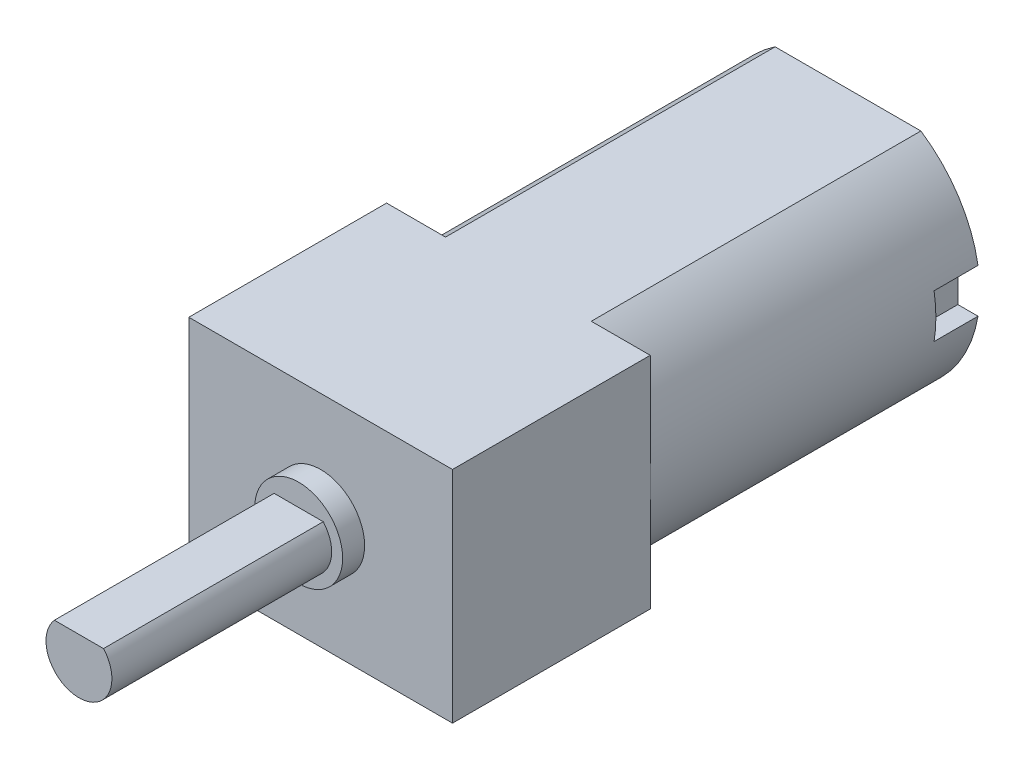
ISO-10303-21;
HEADER;
FILE_DESCRIPTION(('STEP AP214'),'2;1');
FILE_NAME('part.step','',(''),(''),'','','');
FILE_SCHEMA(('AUTOMOTIVE_DESIGN { 1 0 10303 214 1 1 1 1 }'));
ENDSEC;
DATA;
#1=APPLICATION_CONTEXT('core data for automotive mechanical design processes');
#2=APPLICATION_PROTOCOL_DEFINITION('international standard','automotive_design',2000,#1);
#3=PRODUCT_CONTEXT('',#1,'mechanical');
#4=PRODUCT('Part','Part','',(#3));
#5=PRODUCT_RELATED_PRODUCT_CATEGORY('part','',(#4));
#6=PRODUCT_DEFINITION_FORMATION('','',#4);
#7=PRODUCT_DEFINITION_CONTEXT('part definition',#1,'design');
#8=PRODUCT_DEFINITION('design','',#6,#7);
#9=PRODUCT_DEFINITION_SHAPE('','',#8);
#10=(LENGTH_UNIT() NAMED_UNIT(*) SI_UNIT(.MILLI.,.METRE.));
#11=(NAMED_UNIT(*) PLANE_ANGLE_UNIT() SI_UNIT($,.RADIAN.));
#12=(NAMED_UNIT(*) SI_UNIT($,.STERADIAN.) SOLID_ANGLE_UNIT());
#13=UNCERTAINTY_MEASURE_WITH_UNIT(LENGTH_MEASURE(1.E-05),#10,'distance_accuracy_value','');
#14=(GEOMETRIC_REPRESENTATION_CONTEXT(3) GLOBAL_UNCERTAINTY_ASSIGNED_CONTEXT((#13)) GLOBAL_UNIT_ASSIGNED_CONTEXT((#10,
#11,#12)) REPRESENTATION_CONTEXT('',''));
#15=CARTESIAN_POINT('',(0.,0.,0.));
#16=DIRECTION('',(0.,0.,1.));
#17=DIRECTION('',(1.,0.,0.));
#18=AXIS2_PLACEMENT_3D('',#15,#16,#17);
#19=CARTESIAN_POINT('',(0.,5.,0.));
#20=DIRECTION('',(0.,0.,1.));
#21=DIRECTION('',(1.,0.,0.));
#22=AXIS2_PLACEMENT_3D('',#19,#20,#21);
#23=PLANE('',#22);
#24=CARTESIAN_POINT('',(0.,5.,0.));
#25=DIRECTION('',(0.,0.,1.));
#26=DIRECTION('',(1.,0.,0.));
#27=AXIS2_PLACEMENT_3D('',#24,#25,#26);
#28=CIRCLE('',#27,2.5);
#29=CARTESIAN_POINT('',(2.5,5.,0.));
#30=VERTEX_POINT('',#29);
#31=EDGE_CURVE('E283',#30,#30,#28,.T.);
#32=ORIENTED_EDGE('',*,*,#31,.T.);
#33=EDGE_LOOP('',(#32));
#34=FACE_BOUND('',#33,.T.);
#35=DIRECTION('',(1.,0.,0.));
#36=VECTOR('',#35,1.);
#37=CARTESIAN_POINT('',(-5.,4.,0.));
#38=LINE('',#37,#36);
#39=CARTESIAN_POINT('',(-5.91607978309962,4.,0.));
#40=VERTEX_POINT('',#39);
#41=CARTESIAN_POINT('',(-5.,4.,0.));
#42=VERTEX_POINT('',#41);
#43=EDGE_CURVE('E228',#40,#42,#38,.T.);
#44=ORIENTED_EDGE('',*,*,#43,.T.);
#45=DIRECTION('',(0.,1.,0.));
#46=VECTOR('',#45,1.);
#47=CARTESIAN_POINT('',(-5.,5.,0.));
#48=LINE('',#47,#46);
#49=CARTESIAN_POINT('',(-5.,6.,0.));
#50=VERTEX_POINT('',#49);
#51=EDGE_CURVE('E242',#42,#50,#48,.T.);
#52=ORIENTED_EDGE('',*,*,#51,.T.);
#53=DIRECTION('',(-1.,0.,0.));
#54=VECTOR('',#53,1.);
#55=CARTESIAN_POINT('',(-5.,6.,0.));
#56=LINE('',#55,#54);
#57=CARTESIAN_POINT('',(-5.91607978309962,6.,0.));
#58=VERTEX_POINT('',#57);
#59=EDGE_CURVE('E233',#50,#58,#56,.T.);
#60=ORIENTED_EDGE('',*,*,#59,.T.);
#61=CARTESIAN_POINT('',(0.,5.,0.));
#62=DIRECTION('',(0.,0.,1.));
#63=DIRECTION('',(1.,0.,0.));
#64=AXIS2_PLACEMENT_3D('',#61,#62,#63);
#65=CIRCLE('',#64,6.);
#66=CARTESIAN_POINT('',(-3.31662479035541,10.,0.));
#67=VERTEX_POINT('',#66);
#68=EDGE_CURVE('E297',#67,#58,#65,.T.);
#69=ORIENTED_EDGE('',*,*,#68,.F.);
#70=DIRECTION('',(-1.,0.,0.));
#71=VECTOR('',#70,1.);
#72=CARTESIAN_POINT('',(-3.31662479035541,10.,0.));
#73=LINE('',#72,#71);
#74=CARTESIAN_POINT('',(3.31662479035541,10.,0.));
#75=VERTEX_POINT('',#74);
#76=EDGE_CURVE('E306',#75,#67,#73,.T.);
#77=ORIENTED_EDGE('',*,*,#76,.F.);
#78=CARTESIAN_POINT('',(0.,5.,0.));
#79=DIRECTION('',(0.,0.,1.));
#80=DIRECTION('',(-1.,0.,0.));
#81=AXIS2_PLACEMENT_3D('',#78,#79,#80);
#82=CIRCLE('',#81,6.);
#83=CARTESIAN_POINT('',(5.91607978309962,6.,0.));
#84=VERTEX_POINT('',#83);
#85=EDGE_CURVE('E302',#84,#75,#82,.T.);
#86=ORIENTED_EDGE('',*,*,#85,.F.);
#87=DIRECTION('',(-1.,0.,0.));
#88=VECTOR('',#87,1.);
#89=CARTESIAN_POINT('',(5.,6.,0.));
#90=LINE('',#89,#88);
#91=CARTESIAN_POINT('',(5.,6.,0.));
#92=VERTEX_POINT('',#91);
#93=EDGE_CURVE('E260',#84,#92,#90,.T.);
#94=ORIENTED_EDGE('',*,*,#93,.T.);
#95=DIRECTION('',(0.,-1.,0.));
#96=VECTOR('',#95,1.);
#97=CARTESIAN_POINT('',(5.,5.,0.));
#98=LINE('',#97,#96);
#99=CARTESIAN_POINT('',(5.,4.,0.));
#100=VERTEX_POINT('',#99);
#101=EDGE_CURVE('E256',#92,#100,#98,.T.);
#102=ORIENTED_EDGE('',*,*,#101,.T.);
#103=DIRECTION('',(1.,0.,0.));
#104=VECTOR('',#103,1.);
#105=CARTESIAN_POINT('',(5.,4.,0.));
#106=LINE('',#105,#104);
#107=CARTESIAN_POINT('',(5.91607978309962,4.,0.));
#108=VERTEX_POINT('',#107);
#109=EDGE_CURVE('E270',#100,#108,#106,.T.);
#110=ORIENTED_EDGE('',*,*,#109,.T.);
#111=CARTESIAN_POINT('',(3.31662479035541,0.,0.));
#112=VERTEX_POINT('',#111);
#113=EDGE_CURVE('E303',#112,#108,#82,.T.);
#114=ORIENTED_EDGE('',*,*,#113,.F.);
#115=DIRECTION('',(1.,0.,0.));
#116=VECTOR('',#115,1.);
#117=CARTESIAN_POINT('',(-3.31662479035541,0.,0.));
#118=LINE('',#117,#116);
#119=CARTESIAN_POINT('',(-3.31662479035541,0.,0.));
#120=VERTEX_POINT('',#119);
#121=EDGE_CURVE('E300',#120,#112,#118,.T.);
#122=ORIENTED_EDGE('',*,*,#121,.F.);
#123=EDGE_CURVE('E287',#40,#120,#65,.T.);
#124=ORIENTED_EDGE('',*,*,#123,.F.);
#125=EDGE_LOOP('',(#44,#52,#60,#69,#77,#86,#94,#102,#110,#114,#122,#124));
#126=FACE_BOUND('',#125,.T.);
#127=ADVANCED_FACE('F35',(#34,#126),#23,.F.);
#128=CARTESIAN_POINT('',(0.,5.,15.));
#129=DIRECTION('',(0.,0.,-1.));
#130=DIRECTION('',(-1.,0.,0.));
#131=AXIS2_PLACEMENT_3D('',#128,#129,#130);
#132=CYLINDRICAL_SURFACE('',#131,6.);
#133=DIRECTION('',(0.,0.,-1.));
#134=VECTOR('',#133,1.);
#135=CARTESIAN_POINT('',(-5.91607978309962,4.,2.));
#136=LINE('',#135,#134);
#137=CARTESIAN_POINT('',(-5.91607978309962,4.,2.));
#138=VERTEX_POINT('',#137);
#139=EDGE_CURVE('E253',#138,#40,#136,.T.);
#140=ORIENTED_EDGE('',*,*,#139,.T.);
#141=ORIENTED_EDGE('',*,*,#123,.T.);
#142=DIRECTION('',(0.,0.,-1.));
#143=VECTOR('',#142,1.);
#144=CARTESIAN_POINT('',(-3.31662479035541,0.,15.));
#145=LINE('',#144,#143);
#146=CARTESIAN_POINT('',(-3.31662479035541,0.,15.));
#147=VERTEX_POINT('',#146);
#148=EDGE_CURVE('E11',#147,#120,#145,.T.);
#149=ORIENTED_EDGE('',*,*,#148,.F.);
#150=CARTESIAN_POINT('',(0.,5.,15.));
#151=DIRECTION('',(0.,0.,1.));
#152=DIRECTION('',(1.,0.,0.));
#153=AXIS2_PLACEMENT_3D('',#150,#151,#152);
#154=CIRCLE('',#153,6.);
#155=CARTESIAN_POINT('',(-6.,5.,15.));
#156=VERTEX_POINT('',#155);
#157=EDGE_CURVE('E293',#156,#147,#154,.T.);
#158=ORIENTED_EDGE('',*,*,#157,.F.);
#159=CARTESIAN_POINT('',(-3.31662479035541,10.,15.));
#160=VERTEX_POINT('',#159);
#161=EDGE_CURVE('E290',#160,#156,#154,.T.);
#162=ORIENTED_EDGE('',*,*,#161,.F.);
#163=DIRECTION('',(0.,0.,-1.));
#164=VECTOR('',#163,1.);
#165=CARTESIAN_POINT('',(-3.31662479035541,10.,15.));
#166=LINE('',#165,#164);
#167=EDGE_CURVE('E296',#160,#67,#166,.T.);
#168=ORIENTED_EDGE('',*,*,#167,.T.);
#169=ORIENTED_EDGE('',*,*,#68,.T.);
#170=DIRECTION('',(0.,0.,-1.));
#171=VECTOR('',#170,1.);
#172=CARTESIAN_POINT('',(-5.91607978309962,6.,2.));
#173=LINE('',#172,#171);
#174=CARTESIAN_POINT('',(-5.91607978309962,6.,2.));
#175=VERTEX_POINT('',#174);
#176=EDGE_CURVE('E239',#175,#58,#173,.T.);
#177=ORIENTED_EDGE('',*,*,#176,.F.);
#178=CARTESIAN_POINT('',(0.,5.,2.));
#179=DIRECTION('',(0.,0.,1.));
#180=DIRECTION('',(-1.,0.,0.));
#181=AXIS2_PLACEMENT_3D('',#178,#179,#180);
#182=CIRCLE('',#181,6.00000000000001);
#183=EDGE_CURVE('E229',#175,#138,#182,.T.);
#184=ORIENTED_EDGE('',*,*,#183,.T.);
#185=EDGE_LOOP('',(#140,#141,#149,#158,#162,#168,#169,#177,#184));
#186=FACE_BOUND('',#185,.T.);
#187=ADVANCED_FACE('F37',(#186),#132,.T.);
#188=CARTESIAN_POINT('',(0.,5.,15.));
#189=DIRECTION('',(0.,0.,-1.));
#190=DIRECTION('',(-1.,0.,0.));
#191=AXIS2_PLACEMENT_3D('',#188,#189,#190);
#192=CYLINDRICAL_SURFACE('',#191,6.);
#193=DIRECTION('',(0.,0.,-1.));
#194=VECTOR('',#193,1.);
#195=CARTESIAN_POINT('',(5.91607978309962,4.,2.));
#196=LINE('',#195,#194);
#197=CARTESIAN_POINT('',(5.91607978309962,4.,2.));
#198=VERTEX_POINT('',#197);
#199=EDGE_CURVE('E279',#198,#108,#196,.T.);
#200=ORIENTED_EDGE('',*,*,#199,.F.);
#201=CARTESIAN_POINT('',(0.,5.,2.));
#202=DIRECTION('',(0.,0.,1.));
#203=DIRECTION('',(1.,0.,0.));
#204=AXIS2_PLACEMENT_3D('',#201,#202,#203);
#205=CIRCLE('',#204,6.00000000000001);
#206=CARTESIAN_POINT('',(5.91607978309962,6.,2.));
#207=VERTEX_POINT('',#206);
#208=EDGE_CURVE('E262',#198,#207,#205,.T.);
#209=ORIENTED_EDGE('',*,*,#208,.T.);
#210=DIRECTION('',(0.,0.,-1.));
#211=VECTOR('',#210,1.);
#212=CARTESIAN_POINT('',(5.91607978309962,6.,2.));
#213=LINE('',#212,#211);
#214=EDGE_CURVE('E276',#207,#84,#213,.T.);
#215=ORIENTED_EDGE('',*,*,#214,.T.);
#216=ORIENTED_EDGE('',*,*,#85,.T.);
#217=DIRECTION('',(0.,0.,-1.));
#218=VECTOR('',#217,1.);
#219=CARTESIAN_POINT('',(3.31662479035541,10.,15.));
#220=LINE('',#219,#218);
#221=CARTESIAN_POINT('',(3.31662479035541,10.,15.));
#222=VERTEX_POINT('',#221);
#223=EDGE_CURVE('E310',#222,#75,#220,.T.);
#224=ORIENTED_EDGE('',*,*,#223,.F.);
#225=CARTESIAN_POINT('',(0.,5.,15.));
#226=DIRECTION('',(0.,0.,1.));
#227=DIRECTION('',(-1.,0.,0.));
#228=AXIS2_PLACEMENT_3D('',#225,#226,#227);
#229=CIRCLE('',#228,6.);
#230=CARTESIAN_POINT('',(6.,5.,15.));
#231=VERTEX_POINT('',#230);
#232=EDGE_CURVE('E58',#231,#222,#229,.T.);
#233=ORIENTED_EDGE('',*,*,#232,.F.);
#234=CARTESIAN_POINT('',(3.31662479035541,0.,15.));
#235=VERTEX_POINT('',#234);
#236=EDGE_CURVE('E294',#235,#231,#229,.T.);
#237=ORIENTED_EDGE('',*,*,#236,.F.);
#238=DIRECTION('',(0.,0.,-1.));
#239=VECTOR('',#238,1.);
#240=CARTESIAN_POINT('',(3.31662479035541,0.,15.));
#241=LINE('',#240,#239);
#242=EDGE_CURVE('E43',#235,#112,#241,.T.);
#243=ORIENTED_EDGE('',*,*,#242,.T.);
#244=ORIENTED_EDGE('',*,*,#113,.T.);
#245=EDGE_LOOP('',(#200,#209,#215,#216,#224,#233,#237,#243,#244));
#246=FACE_BOUND('',#245,.T.);
#247=ADVANCED_FACE('F315',(#246),#192,.T.);
#248=CARTESIAN_POINT('',(-3.31662479035541,0.,15.));
#249=DIRECTION('',(0.,1.,0.));
#250=DIRECTION('',(0.,0.,1.));
#251=AXIS2_PLACEMENT_3D('',#248,#249,#250);
#252=PLANE('',#251);
#253=ORIENTED_EDGE('',*,*,#121,.T.);
#254=ORIENTED_EDGE('',*,*,#242,.F.);
#255=DIRECTION('',(1.,0.,0.));
#256=VECTOR('',#255,1.);
#257=CARTESIAN_POINT('',(0.,0.,15.));
#258=LINE('',#257,#256);
#259=CARTESIAN_POINT('',(6.,0.,15.));
#260=VERTEX_POINT('',#259);
#261=EDGE_CURVE('E191',#235,#260,#258,.T.);
#262=ORIENTED_EDGE('',*,*,#261,.T.);
#263=DIRECTION('',(0.,0.,-1.));
#264=VECTOR('',#263,1.);
#265=CARTESIAN_POINT('',(6.,0.,24.));
#266=LINE('',#265,#264);
#267=CARTESIAN_POINT('',(6.,0.,24.));
#268=VERTEX_POINT('',#267);
#269=EDGE_CURVE('E225',#268,#260,#266,.T.);
#270=ORIENTED_EDGE('',*,*,#269,.F.);
#271=DIRECTION('',(1.,0.,0.));
#272=VECTOR('',#271,1.);
#273=CARTESIAN_POINT('',(-6.,0.,24.));
#274=LINE('',#273,#272);
#275=CARTESIAN_POINT('',(-6.,0.,24.));
#276=VERTEX_POINT('',#275);
#277=EDGE_CURVE('E193',#276,#268,#274,.T.);
#278=ORIENTED_EDGE('',*,*,#277,.F.);
#279=DIRECTION('',(0.,0.,-1.));
#280=VECTOR('',#279,1.);
#281=CARTESIAN_POINT('',(-6.,0.,24.));
#282=LINE('',#281,#280);
#283=CARTESIAN_POINT('',(-6.,0.,15.));
#284=VERTEX_POINT('',#283);
#285=EDGE_CURVE('E202',#276,#284,#282,.T.);
#286=ORIENTED_EDGE('',*,*,#285,.T.);
#287=EDGE_CURVE('E203',#284,#147,#258,.T.);
#288=ORIENTED_EDGE('',*,*,#287,.T.);
#289=ORIENTED_EDGE('',*,*,#148,.T.);
#290=EDGE_LOOP('',(#253,#254,#262,#270,#278,#286,#288,#289));
#291=FACE_BOUND('',#290,.T.);
#292=ADVANCED_FACE('F355',(#291),#252,.F.);
#293=CARTESIAN_POINT('',(-3.31662479035541,10.,15.));
#294=DIRECTION('',(0.,-1.,0.));
#295=DIRECTION('',(0.,0.,-1.));
#296=AXIS2_PLACEMENT_3D('',#293,#294,#295);
#297=PLANE('',#296);
#298=ORIENTED_EDGE('',*,*,#76,.T.);
#299=ORIENTED_EDGE('',*,*,#167,.F.);
#300=DIRECTION('',(-1.,0.,0.));
#301=VECTOR('',#300,1.);
#302=CARTESIAN_POINT('',(-6.,10.,15.));
#303=LINE('',#302,#301);
#304=CARTESIAN_POINT('',(-6.,10.,15.));
#305=VERTEX_POINT('',#304);
#306=EDGE_CURVE('E210',#160,#305,#303,.T.);
#307=ORIENTED_EDGE('',*,*,#306,.T.);
#308=DIRECTION('',(0.,0.,-1.));
#309=VECTOR('',#308,1.);
#310=CARTESIAN_POINT('',(-6.,10.,24.));
#311=LINE('',#310,#309);
#312=CARTESIAN_POINT('',(-6.,10.,24.));
#313=VERTEX_POINT('',#312);
#314=EDGE_CURVE('E219',#313,#305,#311,.T.);
#315=ORIENTED_EDGE('',*,*,#314,.F.);
#316=DIRECTION('',(-1.,0.,0.));
#317=VECTOR('',#316,1.);
#318=CARTESIAN_POINT('',(-6.,10.,24.));
#319=LINE('',#318,#317);
#320=CARTESIAN_POINT('',(6.,10.,24.));
#321=VERTEX_POINT('',#320);
#322=EDGE_CURVE('E198',#321,#313,#319,.T.);
#323=ORIENTED_EDGE('',*,*,#322,.F.);
#324=DIRECTION('',(0.,0.,-1.));
#325=VECTOR('',#324,1.);
#326=CARTESIAN_POINT('',(6.,10.,24.));
#327=LINE('',#326,#325);
#328=CARTESIAN_POINT('',(6.,10.,15.));
#329=VERTEX_POINT('',#328);
#330=EDGE_CURVE('E222',#321,#329,#327,.T.);
#331=ORIENTED_EDGE('',*,*,#330,.T.);
#332=EDGE_CURVE('E211',#329,#222,#303,.T.);
#333=ORIENTED_EDGE('',*,*,#332,.T.);
#334=ORIENTED_EDGE('',*,*,#223,.T.);
#335=EDGE_LOOP('',(#298,#299,#307,#315,#323,#331,#333,#334));
#336=FACE_BOUND('',#335,.T.);
#337=ADVANCED_FACE('F341',(#336),#297,.F.);
#338=CARTESIAN_POINT('',(0.,5.,-0.999999999999998));
#339=DIRECTION('',(0.,0.,1.));
#340=DIRECTION('',(1.,0.,0.));
#341=AXIS2_PLACEMENT_3D('',#338,#339,#340);
#342=CYLINDRICAL_SURFACE('',#341,2.5);
#343=CARTESIAN_POINT('',(0.,5.,-0.999999999999998));
#344=DIRECTION('',(0.,0.,1.));
#345=DIRECTION('',(1.,0.,0.));
#346=AXIS2_PLACEMENT_3D('',#343,#344,#345);
#347=CIRCLE('',#346,2.5);
#348=CARTESIAN_POINT('',(2.5,5.,-0.999999999999998));
#349=VERTEX_POINT('',#348);
#350=EDGE_CURVE('E284',#349,#349,#347,.T.);
#351=ORIENTED_EDGE('',*,*,#350,.T.);
#352=EDGE_LOOP('',(#351));
#353=FACE_BOUND('',#352,.T.);
#354=ORIENTED_EDGE('',*,*,#31,.F.);
#355=EDGE_LOOP('',(#354));
#356=FACE_BOUND('',#355,.T.);
#357=ADVANCED_FACE('F407',(#353,#356),#342,.T.);
#358=CARTESIAN_POINT('',(0.,5.,-0.999999999999998));
#359=DIRECTION('',(0.,0.,1.));
#360=DIRECTION('',(1.,0.,0.));
#361=AXIS2_PLACEMENT_3D('',#358,#359,#360);
#362=PLANE('',#361);
#363=ORIENTED_EDGE('',*,*,#350,.F.);
#364=EDGE_LOOP('',(#363));
#365=FACE_BOUND('',#364,.T.);
#366=ADVANCED_FACE('F428',(#365),#362,.F.);
#367=CARTESIAN_POINT('',(5.,5.,2.));
#368=DIRECTION('',(1.,0.,0.));
#369=DIRECTION('',(0.,0.,-1.));
#370=AXIS2_PLACEMENT_3D('',#367,#368,#369);
#371=PLANE('',#370);
#372=ORIENTED_EDGE('',*,*,#101,.F.);
#373=DIRECTION('',(0.,0.,-1.));
#374=VECTOR('',#373,1.);
#375=CARTESIAN_POINT('',(5.,6.,2.));
#376=LINE('',#375,#374);
#377=CARTESIAN_POINT('',(5.,6.,2.));
#378=VERTEX_POINT('',#377);
#379=EDGE_CURVE('E267',#378,#92,#376,.T.);
#380=ORIENTED_EDGE('',*,*,#379,.F.);
#381=DIRECTION('',(0.,-1.,0.));
#382=VECTOR('',#381,1.);
#383=CARTESIAN_POINT('',(5.,5.,2.));
#384=LINE('',#383,#382);
#385=CARTESIAN_POINT('',(5.,4.,2.));
#386=VERTEX_POINT('',#385);
#387=EDGE_CURVE('E257',#378,#386,#384,.T.);
#388=ORIENTED_EDGE('',*,*,#387,.T.);
#389=DIRECTION('',(0.,0.,-1.));
#390=VECTOR('',#389,1.);
#391=CARTESIAN_POINT('',(5.,4.,2.));
#392=LINE('',#391,#390);
#393=EDGE_CURVE('E281',#386,#100,#392,.T.);
#394=ORIENTED_EDGE('',*,*,#393,.T.);
#395=EDGE_LOOP('',(#372,#380,#388,#394));
#396=FACE_BOUND('',#395,.T.);
#397=ADVANCED_FACE('F337',(#396),#371,.T.);
#398=CARTESIAN_POINT('',(5.,4.,2.));
#399=DIRECTION('',(0.,1.,0.));
#400=DIRECTION('',(0.,0.,1.));
#401=AXIS2_PLACEMENT_3D('',#398,#399,#400);
#402=PLANE('',#401);
#403=ORIENTED_EDGE('',*,*,#109,.F.);
#404=ORIENTED_EDGE('',*,*,#393,.F.);
#405=DIRECTION('',(1.,0.,0.));
#406=VECTOR('',#405,1.);
#407=CARTESIAN_POINT('',(5.,4.,2.));
#408=LINE('',#407,#406);
#409=EDGE_CURVE('E259',#386,#198,#408,.T.);
#410=ORIENTED_EDGE('',*,*,#409,.T.);
#411=ORIENTED_EDGE('',*,*,#199,.T.);
#412=EDGE_LOOP('',(#403,#404,#410,#411));
#413=FACE_BOUND('',#412,.T.);
#414=ADVANCED_FACE('F325',(#413),#402,.T.);
#415=CARTESIAN_POINT('',(5.,6.,2.));
#416=DIRECTION('',(0.,-1.,0.));
#417=DIRECTION('',(0.,0.,-1.));
#418=AXIS2_PLACEMENT_3D('',#415,#416,#417);
#419=PLANE('',#418);
#420=ORIENTED_EDGE('',*,*,#93,.F.);
#421=ORIENTED_EDGE('',*,*,#214,.F.);
#422=DIRECTION('',(-1.,0.,0.));
#423=VECTOR('',#422,1.);
#424=CARTESIAN_POINT('',(5.,6.,2.));
#425=LINE('',#424,#423);
#426=EDGE_CURVE('E265',#207,#378,#425,.T.);
#427=ORIENTED_EDGE('',*,*,#426,.T.);
#428=ORIENTED_EDGE('',*,*,#379,.T.);
#429=EDGE_LOOP('',(#420,#421,#427,#428));
#430=FACE_BOUND('',#429,.T.);
#431=ADVANCED_FACE('F335',(#430),#419,.T.);
#432=CARTESIAN_POINT('',(0.,5.,2.));
#433=DIRECTION('',(0.,0.,1.));
#434=DIRECTION('',(1.,0.,0.));
#435=AXIS2_PLACEMENT_3D('',#432,#433,#434);
#436=PLANE('',#435);
#437=ORIENTED_EDGE('',*,*,#387,.F.);
#438=ORIENTED_EDGE('',*,*,#426,.F.);
#439=ORIENTED_EDGE('',*,*,#208,.F.);
#440=ORIENTED_EDGE('',*,*,#409,.F.);
#441=EDGE_LOOP('',(#437,#438,#439,#440));
#442=FACE_BOUND('',#441,.T.);
#443=ADVANCED_FACE('F332',(#442),#436,.F.);
#444=CARTESIAN_POINT('',(-5.,4.,2.));
#445=DIRECTION('',(0.,1.,0.));
#446=DIRECTION('',(0.,0.,1.));
#447=AXIS2_PLACEMENT_3D('',#444,#445,#446);
#448=PLANE('',#447);
#449=ORIENTED_EDGE('',*,*,#43,.F.);
#450=ORIENTED_EDGE('',*,*,#139,.F.);
#451=DIRECTION('',(1.,0.,0.));
#452=VECTOR('',#451,1.);
#453=CARTESIAN_POINT('',(-5.,4.,2.));
#454=LINE('',#453,#452);
#455=CARTESIAN_POINT('',(-5.,4.,2.));
#456=VERTEX_POINT('',#455);
#457=EDGE_CURVE('E232',#138,#456,#454,.T.);
#458=ORIENTED_EDGE('',*,*,#457,.T.);
#459=DIRECTION('',(0.,0.,-1.));
#460=VECTOR('',#459,1.);
#461=CARTESIAN_POINT('',(-5.,4.,2.));
#462=LINE('',#461,#460);
#463=EDGE_CURVE('E250',#456,#42,#462,.T.);
#464=ORIENTED_EDGE('',*,*,#463,.T.);
#465=EDGE_LOOP('',(#449,#450,#458,#464));
#466=FACE_BOUND('',#465,.T.);
#467=ADVANCED_FACE('F388',(#466),#448,.T.);
#468=CARTESIAN_POINT('',(-5.,5.,2.));
#469=DIRECTION('',(-1.,0.,0.));
#470=DIRECTION('',(0.,0.,1.));
#471=AXIS2_PLACEMENT_3D('',#468,#469,#470);
#472=PLANE('',#471);
#473=ORIENTED_EDGE('',*,*,#51,.F.);
#474=ORIENTED_EDGE('',*,*,#463,.F.);
#475=DIRECTION('',(0.,1.,0.));
#476=VECTOR('',#475,1.);
#477=CARTESIAN_POINT('',(-5.,5.,2.));
#478=LINE('',#477,#476);
#479=CARTESIAN_POINT('',(-5.,6.,2.));
#480=VERTEX_POINT('',#479);
#481=EDGE_CURVE('E235',#456,#480,#478,.T.);
#482=ORIENTED_EDGE('',*,*,#481,.T.);
#483=DIRECTION('',(0.,0.,-1.));
#484=VECTOR('',#483,1.);
#485=CARTESIAN_POINT('',(-5.,6.,2.));
#486=LINE('',#485,#484);
#487=EDGE_CURVE('E248',#480,#50,#486,.T.);
#488=ORIENTED_EDGE('',*,*,#487,.T.);
#489=EDGE_LOOP('',(#473,#474,#482,#488));
#490=FACE_BOUND('',#489,.T.);
#491=ADVANCED_FACE('F390',(#490),#472,.T.);
#492=CARTESIAN_POINT('',(-5.,6.,2.));
#493=DIRECTION('',(0.,-1.,0.));
#494=DIRECTION('',(0.,0.,-1.));
#495=AXIS2_PLACEMENT_3D('',#492,#493,#494);
#496=PLANE('',#495);
#497=ORIENTED_EDGE('',*,*,#59,.F.);
#498=ORIENTED_EDGE('',*,*,#487,.F.);
#499=DIRECTION('',(-1.,0.,0.));
#500=VECTOR('',#499,1.);
#501=CARTESIAN_POINT('',(-5.,6.,2.));
#502=LINE('',#501,#500);
#503=EDGE_CURVE('E237',#480,#175,#502,.T.);
#504=ORIENTED_EDGE('',*,*,#503,.T.);
#505=ORIENTED_EDGE('',*,*,#176,.T.);
#506=EDGE_LOOP('',(#497,#498,#504,#505));
#507=FACE_BOUND('',#506,.T.);
#508=ADVANCED_FACE('F379',(#507),#496,.T.);
#509=CARTESIAN_POINT('',(0.,5.,2.));
#510=DIRECTION('',(0.,0.,-1.));
#511=DIRECTION('',(-1.,0.,0.));
#512=AXIS2_PLACEMENT_3D('',#509,#510,#511);
#513=PLANE('',#512);
#514=ORIENTED_EDGE('',*,*,#183,.F.);
#515=ORIENTED_EDGE('',*,*,#503,.F.);
#516=ORIENTED_EDGE('',*,*,#481,.F.);
#517=ORIENTED_EDGE('',*,*,#457,.F.);
#518=EDGE_LOOP('',(#514,#515,#516,#517));
#519=FACE_BOUND('',#518,.T.);
#520=ADVANCED_FACE('F384',(#519),#513,.T.);
#521=CARTESIAN_POINT('',(0.,0.,15.));
#522=DIRECTION('',(0.,0.,1.));
#523=DIRECTION('',(1.,0.,0.));
#524=AXIS2_PLACEMENT_3D('',#521,#522,#523);
#525=PLANE('',#524);
#526=ORIENTED_EDGE('',*,*,#306,.F.);
#527=ORIENTED_EDGE('',*,*,#161,.T.);
#528=DIRECTION('',(0.,-1.,0.));
#529=VECTOR('',#528,1.);
#530=CARTESIAN_POINT('',(-6.,5.,15.));
#531=LINE('',#530,#529);
#532=EDGE_CURVE('E196',#305,#156,#531,.T.);
#533=ORIENTED_EDGE('',*,*,#532,.F.);
#534=EDGE_LOOP('',(#526,#527,#533));
#535=FACE_BOUND('',#534,.T.);
#536=ADVANCED_FACE('F374',(#535),#525,.F.);
#537=EDGE_CURVE('E214',#156,#284,#531,.T.);
#538=ORIENTED_EDGE('',*,*,#537,.F.);
#539=ORIENTED_EDGE('',*,*,#157,.T.);
#540=ORIENTED_EDGE('',*,*,#287,.F.);
#541=EDGE_LOOP('',(#538,#539,#540));
#542=FACE_BOUND('',#541,.T.);
#543=ADVANCED_FACE('F368',(#542),#525,.F.);
#544=ORIENTED_EDGE('',*,*,#261,.F.);
#545=ORIENTED_EDGE('',*,*,#236,.T.);
#546=DIRECTION('',(0.,1.,0.));
#547=VECTOR('',#546,1.);
#548=CARTESIAN_POINT('',(6.,5.,15.));
#549=LINE('',#548,#547);
#550=EDGE_CURVE('E207',#260,#231,#549,.T.);
#551=ORIENTED_EDGE('',*,*,#550,.F.);
#552=EDGE_LOOP('',(#544,#545,#551));
#553=FACE_BOUND('',#552,.T.);
#554=ADVANCED_FACE('F354',(#553),#525,.F.);
#555=EDGE_CURVE('E206',#231,#329,#549,.T.);
#556=ORIENTED_EDGE('',*,*,#555,.F.);
#557=ORIENTED_EDGE('',*,*,#232,.T.);
#558=ORIENTED_EDGE('',*,*,#332,.F.);
#559=EDGE_LOOP('',(#556,#557,#558));
#560=FACE_BOUND('',#559,.T.);
#561=ADVANCED_FACE('F347',(#560),#525,.F.);
#562=CARTESIAN_POINT('',(6.,5.,24.));
#563=DIRECTION('',(-1.,0.,0.));
#564=DIRECTION('',(0.,0.,1.));
#565=AXIS2_PLACEMENT_3D('',#562,#563,#564);
#566=PLANE('',#565);
#567=ORIENTED_EDGE('',*,*,#550,.T.);
#568=ORIENTED_EDGE('',*,*,#555,.T.);
#569=ORIENTED_EDGE('',*,*,#330,.F.);
#570=DIRECTION('',(0.,1.,0.));
#571=VECTOR('',#570,1.);
#572=CARTESIAN_POINT('',(6.,0.,24.));
#573=LINE('',#572,#571);
#574=EDGE_CURVE('E195',#268,#321,#573,.T.);
#575=ORIENTED_EDGE('',*,*,#574,.F.);
#576=ORIENTED_EDGE('',*,*,#269,.T.);
#577=EDGE_LOOP('',(#567,#568,#569,#575,#576));
#578=FACE_BOUND('',#577,.T.);
#579=ADVANCED_FACE('F350',(#578),#566,.F.);
#580=CARTESIAN_POINT('',(-6.,5.,24.));
#581=DIRECTION('',(1.,0.,0.));
#582=DIRECTION('',(0.,0.,-1.));
#583=AXIS2_PLACEMENT_3D('',#580,#581,#582);
#584=PLANE('',#583);
#585=ORIENTED_EDGE('',*,*,#532,.T.);
#586=ORIENTED_EDGE('',*,*,#537,.T.);
#587=ORIENTED_EDGE('',*,*,#285,.F.);
#588=DIRECTION('',(0.,-1.,0.));
#589=VECTOR('',#588,1.);
#590=CARTESIAN_POINT('',(-6.,5.,24.));
#591=LINE('',#590,#589);
#592=EDGE_CURVE('E200',#313,#276,#591,.T.);
#593=ORIENTED_EDGE('',*,*,#592,.F.);
#594=ORIENTED_EDGE('',*,*,#314,.T.);
#595=EDGE_LOOP('',(#585,#586,#587,#593,#594));
#596=FACE_BOUND('',#595,.T.);
#597=ADVANCED_FACE('F363',(#596),#584,.F.);
#598=CARTESIAN_POINT('',(0.,0.,24.));
#599=DIRECTION('',(0.,0.,1.));
#600=DIRECTION('',(1.,0.,0.));
#601=AXIS2_PLACEMENT_3D('',#598,#599,#600);
#602=PLANE('',#601);
#603=CARTESIAN_POINT('',(0.,5.,24.));
#604=DIRECTION('',(0.,0.,1.));
#605=DIRECTION('',(1.,0.,0.));
#606=AXIS2_PLACEMENT_3D('',#603,#604,#605);
#607=CIRCLE('',#606,2.);
#608=CARTESIAN_POINT('',(2.,5.,24.));
#609=VERTEX_POINT('',#608);
#610=EDGE_CURVE('E182',#609,#609,#607,.T.);
#611=ORIENTED_EDGE('',*,*,#610,.F.);
#612=EDGE_LOOP('',(#611));
#613=FACE_BOUND('',#612,.T.);
#614=ORIENTED_EDGE('',*,*,#277,.T.);
#615=ORIENTED_EDGE('',*,*,#574,.T.);
#616=ORIENTED_EDGE('',*,*,#322,.T.);
#617=ORIENTED_EDGE('',*,*,#592,.T.);
#618=EDGE_LOOP('',(#614,#615,#616,#617));
#619=FACE_BOUND('',#618,.T.);
#620=ADVANCED_FACE('F358',(#613,#619),#602,.T.);
#621=CARTESIAN_POINT('',(0.,5.,25.));
#622=DIRECTION('',(0.,0.,-1.));
#623=DIRECTION('',(-1.,0.,0.));
#624=AXIS2_PLACEMENT_3D('',#621,#622,#623);
#625=CYLINDRICAL_SURFACE('',#624,2.);
#626=CARTESIAN_POINT('',(0.,5.,25.));
#627=DIRECTION('',(0.,0.,1.));
#628=DIRECTION('',(1.,0.,0.));
#629=AXIS2_PLACEMENT_3D('',#626,#627,#628);
#630=CIRCLE('',#629,2.);
#631=CARTESIAN_POINT('',(2.,5.,25.));
#632=VERTEX_POINT('',#631);
#633=EDGE_CURVE('E185',#632,#632,#630,.T.);
#634=ORIENTED_EDGE('',*,*,#633,.F.);
#635=EDGE_LOOP('',(#634));
#636=FACE_BOUND('',#635,.T.);
#637=ORIENTED_EDGE('',*,*,#610,.T.);
#638=EDGE_LOOP('',(#637));
#639=FACE_BOUND('',#638,.T.);
#640=ADVANCED_FACE('F564',(#636,#639),#625,.T.);
#641=CARTESIAN_POINT('',(0.,5.,25.));
#642=DIRECTION('',(0.,0.,1.));
#643=DIRECTION('',(1.,0.,0.));
#644=AXIS2_PLACEMENT_3D('',#641,#642,#643);
#645=PLANE('',#644);
#646=CARTESIAN_POINT('',(0.,5.,25.));
#647=DIRECTION('',(0.,0.,1.));
#648=DIRECTION('',(1.,0.,0.));
#649=AXIS2_PLACEMENT_3D('',#646,#647,#648);
#650=CIRCLE('',#649,1.5);
#651=CARTESIAN_POINT('',(-1.1180339887499,6.,25.));
#652=VERTEX_POINT('',#651);
#653=CARTESIAN_POINT('',(1.1180339887499,6.,25.));
#654=VERTEX_POINT('',#653);
#655=EDGE_CURVE('E179',#652,#654,#650,.T.);
#656=ORIENTED_EDGE('',*,*,#655,.F.);
#657=DIRECTION('',(-1.,0.,0.));
#658=VECTOR('',#657,1.);
#659=CARTESIAN_POINT('',(0.,6.,25.));
#660=LINE('',#659,#658);
#661=EDGE_CURVE('E50',#654,#652,#660,.T.);
#662=ORIENTED_EDGE('',*,*,#661,.F.);
#663=EDGE_LOOP('',(#656,#662));
#664=FACE_BOUND('',#663,.T.);
#665=ORIENTED_EDGE('',*,*,#633,.T.);
#666=EDGE_LOOP('',(#665));
#667=FACE_BOUND('',#666,.T.);
#668=ADVANCED_FACE('F573',(#664,#667),#645,.T.);
#669=CARTESIAN_POINT('',(0.,6.,35.));
#670=DIRECTION('',(0.,-1.,0.));
#671=DIRECTION('',(0.,0.,-1.));
#672=AXIS2_PLACEMENT_3D('',#669,#670,#671);
#673=PLANE('',#672);
#674=ORIENTED_EDGE('',*,*,#661,.T.);
#675=DIRECTION('',(0.,0.,-1.));
#676=VECTOR('',#675,1.);
#677=CARTESIAN_POINT('',(-1.1180339887499,6.,35.));
#678=LINE('',#677,#676);
#679=CARTESIAN_POINT('',(-1.1180339887499,6.,35.));
#680=VERTEX_POINT('',#679);
#681=EDGE_CURVE('E171',#680,#652,#678,.T.);
#682=ORIENTED_EDGE('',*,*,#681,.F.);
#683=DIRECTION('',(-1.,0.,0.));
#684=VECTOR('',#683,1.);
#685=CARTESIAN_POINT('',(0.,6.,35.));
#686=LINE('',#685,#684);
#687=CARTESIAN_POINT('',(1.1180339887499,6.,35.));
#688=VERTEX_POINT('',#687);
#689=EDGE_CURVE('E176',#688,#680,#686,.T.);
#690=ORIENTED_EDGE('',*,*,#689,.F.);
#691=DIRECTION('',(0.,0.,-1.));
#692=VECTOR('',#691,1.);
#693=CARTESIAN_POINT('',(1.1180339887499,6.,35.));
#694=LINE('',#693,#692);
#695=EDGE_CURVE('E173',#688,#654,#694,.T.);
#696=ORIENTED_EDGE('',*,*,#695,.T.);
#697=EDGE_LOOP('',(#674,#682,#690,#696));
#698=FACE_BOUND('',#697,.T.);
#699=ADVANCED_FACE('F181',(#698),#673,.F.);
#700=CARTESIAN_POINT('',(0.,5.,35.));
#701=DIRECTION('',(0.,0.,-1.));
#702=DIRECTION('',(-1.,0.,0.));
#703=AXIS2_PLACEMENT_3D('',#700,#701,#702);
#704=CYLINDRICAL_SURFACE('',#703,1.5);
#705=ORIENTED_EDGE('',*,*,#655,.T.);
#706=ORIENTED_EDGE('',*,*,#695,.F.);
#707=CARTESIAN_POINT('',(0.,5.,35.));
#708=DIRECTION('',(0.,0.,1.));
#709=DIRECTION('',(1.,0.,0.));
#710=AXIS2_PLACEMENT_3D('',#707,#708,#709);
#711=CIRCLE('',#710,1.5);
#712=EDGE_CURVE('E168',#680,#688,#711,.T.);
#713=ORIENTED_EDGE('',*,*,#712,.F.);
#714=ORIENTED_EDGE('',*,*,#681,.T.);
#715=EDGE_LOOP('',(#705,#706,#713,#714));
#716=FACE_BOUND('',#715,.T.);
#717=ADVANCED_FACE('F170',(#716),#704,.T.);
#718=CARTESIAN_POINT('',(0.,0.,35.));
#719=DIRECTION('',(0.,0.,1.));
#720=DIRECTION('',(1.,0.,0.));
#721=AXIS2_PLACEMENT_3D('',#718,#719,#720);
#722=PLANE('',#721);
#723=ORIENTED_EDGE('',*,*,#689,.T.);
#724=ORIENTED_EDGE('',*,*,#712,.T.);
#725=EDGE_LOOP('',(#723,#724));
#726=FACE_BOUND('',#725,.T.);
#727=ADVANCED_FACE('F178',(#726),#722,.T.);
#728=CLOSED_SHELL('',(#127,#187,#247,#292,#337,#357,#366,#397,#414,#431,#443,#467,#491,#508,
#520,#536,#543,#554,#561,#579,#597,#620,#640,#668,#699,#717,#727));
#729=MANIFOLD_SOLID_BREP('B2',#728);
#730=ADVANCED_BREP_SHAPE_REPRESENTATION('',(#18,#729),#14);
#731=SHAPE_DEFINITION_REPRESENTATION(#9,#730);
ENDSEC;
END-ISO-10303-21;
